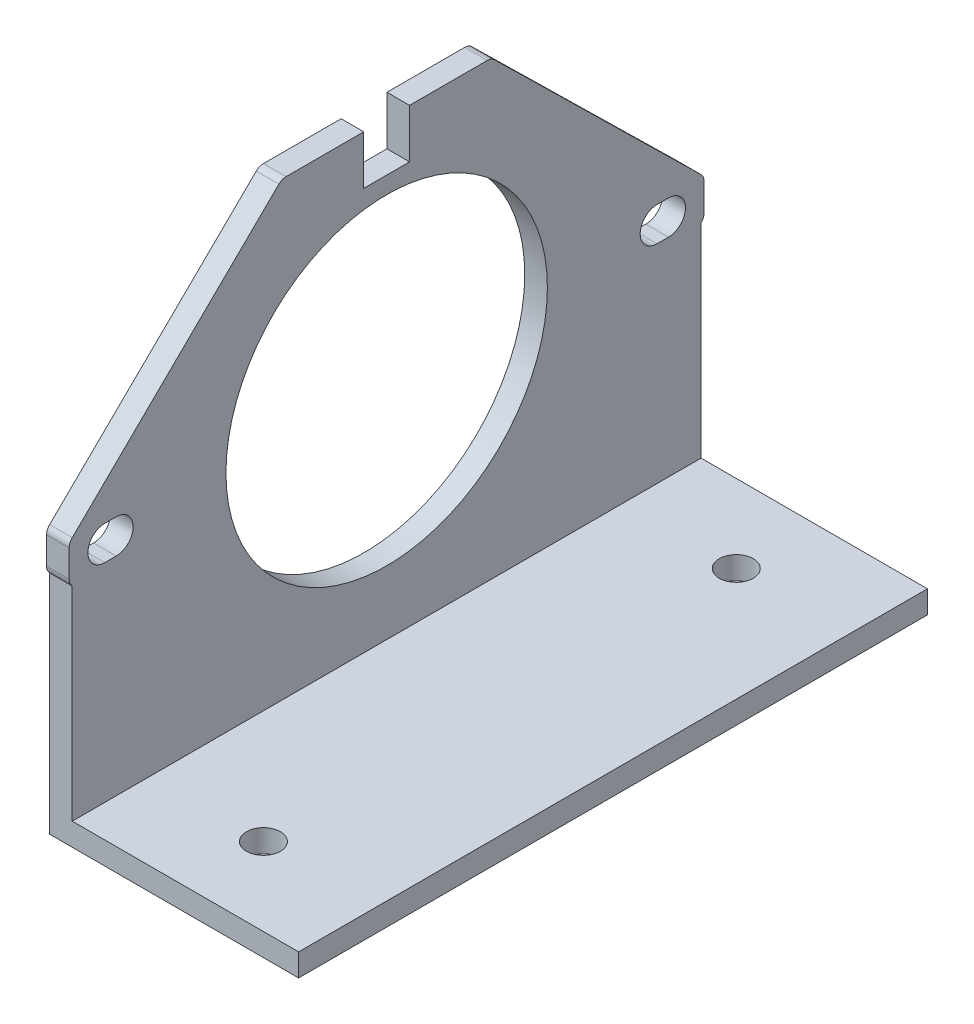
ISO-10303-21;
HEADER;
FILE_DESCRIPTION(('STEP AP214'),'2;1');
FILE_NAME('part.step','',(''),(''),'','','');
FILE_SCHEMA(('AUTOMOTIVE_DESIGN { 1 0 10303 214 1 1 1 1 }'));
ENDSEC;
DATA;
#1=APPLICATION_CONTEXT('core data for automotive mechanical design processes');
#2=APPLICATION_PROTOCOL_DEFINITION('international standard','automotive_design',2000,#1);
#3=PRODUCT_CONTEXT('',#1,'mechanical');
#4=PRODUCT('Part','Part','',(#3));
#5=PRODUCT_RELATED_PRODUCT_CATEGORY('part','',(#4));
#6=PRODUCT_DEFINITION_FORMATION('','',#4);
#7=PRODUCT_DEFINITION_CONTEXT('part definition',#1,'design');
#8=PRODUCT_DEFINITION('design','',#6,#7);
#9=PRODUCT_DEFINITION_SHAPE('','',#8);
#10=(LENGTH_UNIT() NAMED_UNIT(*) SI_UNIT(.MILLI.,.METRE.));
#11=(NAMED_UNIT(*) PLANE_ANGLE_UNIT() SI_UNIT($,.RADIAN.));
#12=(NAMED_UNIT(*) SI_UNIT($,.STERADIAN.) SOLID_ANGLE_UNIT());
#13=UNCERTAINTY_MEASURE_WITH_UNIT(LENGTH_MEASURE(1.E-05),#10,'distance_accuracy_value','');
#14=(GEOMETRIC_REPRESENTATION_CONTEXT(3) GLOBAL_UNCERTAINTY_ASSIGNED_CONTEXT((#13)) GLOBAL_UNIT_ASSIGNED_CONTEXT((#10,
#11,#12)) REPRESENTATION_CONTEXT('',''));
#15=CARTESIAN_POINT('',(0.,0.,0.));
#16=DIRECTION('',(0.,0.,1.));
#17=DIRECTION('',(1.,0.,0.));
#18=AXIS2_PLACEMENT_3D('',#15,#16,#17);
#19=CARTESIAN_POINT('',(609.088883620938,876.694420906275,-1.75182171762627E-12));
#20=DIRECTION('',(0.,-1.,0.));
#21=DIRECTION('',(0.,0.,-1.));
#22=AXIS2_PLACEMENT_3D('',#19,#20,#21);
#23=PLANE('',#22);
#24=CARTESIAN_POINT('',(680.139739498127,876.694420906278,1325.7007075967));
#25=DIRECTION('',(0.,-1.,0.));
#26=DIRECTION('',(0.,0.,-1.));
#27=AXIS2_PLACEMENT_3D('',#24,#25,#26);
#28=CIRCLE('',#27,1.49999999999994);
#29=CARTESIAN_POINT('',(680.139739498127,876.694420906278,1324.2007075967));
#30=VERTEX_POINT('',#29);
#31=EDGE_CURVE('E687',#30,#30,#28,.T.);
#32=ORIENTED_EDGE('',*,*,#31,.F.);
#33=EDGE_LOOP('',(#32));
#34=FACE_BOUND('',#33,.T.);
#35=DIRECTION('',(0.,0.,1.));
#36=VECTOR('',#35,1.);
#37=CARTESIAN_POINT('',(668.139739498127,876.694420906275,-1.75182171762627E-12));
#38=LINE('',#37,#36);
#39=CARTESIAN_POINT('',(668.139739498127,876.694420906278,1277.03010028587));
#40=VERTEX_POINT('',#39);
#41=CARTESIAN_POINT('',(668.139739498127,876.694420906278,1332.59091003364));
#42=VERTEX_POINT('',#41);
#43=EDGE_CURVE('E429',#40,#42,#38,.T.);
#44=ORIENTED_EDGE('',*,*,#43,.F.);
#45=DIRECTION('',(1.,0.,0.));
#46=VECTOR('',#45,1.);
#47=CARTESIAN_POINT('',(609.088883620938,876.694420906278,1277.03010028587));
#48=LINE('',#47,#46);
#49=CARTESIAN_POINT('',(690.139739498127,876.694420906278,1277.03010028587));
#50=VERTEX_POINT('',#49);
#51=EDGE_CURVE('E424',#40,#50,#48,.T.);
#52=ORIENTED_EDGE('',*,*,#51,.T.);
#53=DIRECTION('',(0.,0.,-1.));
#54=VECTOR('',#53,1.);
#55=CARTESIAN_POINT('',(690.139739498127,876.694420906275,-1.75182171762627E-12));
#56=LINE('',#55,#54);
#57=CARTESIAN_POINT('',(690.139739498127,876.694420906278,1332.59091003364));
#58=VERTEX_POINT('',#57);
#59=EDGE_CURVE('E662',#58,#50,#56,.T.);
#60=ORIENTED_EDGE('',*,*,#59,.F.);
#61=DIRECTION('',(1.,0.,0.));
#62=VECTOR('',#61,1.);
#63=CARTESIAN_POINT('',(609.088883620938,876.694420906278,1332.59091003364));
#64=LINE('',#63,#62);
#65=EDGE_CURVE('E568',#42,#58,#64,.T.);
#66=ORIENTED_EDGE('',*,*,#65,.F.);
#67=EDGE_LOOP('',(#44,#52,#60,#66));
#68=FACE_BOUND('',#67,.T.);
#69=CARTESIAN_POINT('',(680.139739498127,876.694420906278,1283.92030272281));
#70=DIRECTION('',(0.,-1.,0.));
#71=DIRECTION('',(0.,0.,-1.));
#72=AXIS2_PLACEMENT_3D('',#69,#70,#71);
#73=CIRCLE('',#72,1.49999999999994);
#74=CARTESIAN_POINT('',(680.139739498127,876.694420906278,1282.42030272281));
#75=VERTEX_POINT('',#74);
#76=EDGE_CURVE('E676',#75,#75,#73,.F.);
#77=ORIENTED_EDGE('',*,*,#76,.T.);
#78=EDGE_LOOP('',(#77));
#79=FACE_BOUND('',#78,.T.);
#80=ADVANCED_FACE('F45',(#34,#68,#79),#23,.T.);
#81=CARTESIAN_POINT('',(690.139739498127,878.694420906278,0.));
#82=DIRECTION('',(0.,1.,0.));
#83=DIRECTION('',(0.,0.,1.));
#84=AXIS2_PLACEMENT_3D('',#81,#82,#83);
#85=PLANE('',#84);
#86=CARTESIAN_POINT('',(680.139739498127,878.694420906278,1325.7007075967));
#87=DIRECTION('',(0.,1.,0.));
#88=DIRECTION('',(0.,0.,1.));
#89=AXIS2_PLACEMENT_3D('',#86,#87,#88);
#90=CIRCLE('',#89,1.49999999999994);
#91=CARTESIAN_POINT('',(680.139739498127,878.694420906278,1327.2007075967));
#92=VERTEX_POINT('',#91);
#93=EDGE_CURVE('E694',#92,#92,#90,.F.);
#94=ORIENTED_EDGE('',*,*,#93,.T.);
#95=EDGE_LOOP('',(#94));
#96=FACE_BOUND('',#95,.T.);
#97=DIRECTION('',(0.,0.,-1.));
#98=VECTOR('',#97,1.);
#99=CARTESIAN_POINT('',(670.139739498127,878.694420906278,0.));
#100=LINE('',#99,#98);
#101=CARTESIAN_POINT('',(670.139739498127,878.694420906278,1332.59091003364));
#102=VERTEX_POINT('',#101);
#103=CARTESIAN_POINT('',(670.139739498127,878.694420906278,1277.03010028587));
#104=VERTEX_POINT('',#103);
#105=EDGE_CURVE('E640',#102,#104,#100,.T.);
#106=ORIENTED_EDGE('',*,*,#105,.F.);
#107=DIRECTION('',(-1.,0.,0.));
#108=VECTOR('',#107,1.);
#109=CARTESIAN_POINT('',(690.139739498127,878.694420906278,1332.59091003364));
#110=LINE('',#109,#108);
#111=CARTESIAN_POINT('',(690.139739498127,878.694420906278,1332.59091003364));
#112=VERTEX_POINT('',#111);
#113=EDGE_CURVE('E647',#112,#102,#110,.T.);
#114=ORIENTED_EDGE('',*,*,#113,.F.);
#115=DIRECTION('',(0.,0.,-1.));
#116=VECTOR('',#115,1.);
#117=CARTESIAN_POINT('',(690.139739498127,878.694420906278,0.));
#118=LINE('',#117,#116);
#119=CARTESIAN_POINT('',(690.139739498127,878.694420906278,1277.03010028587));
#120=VERTEX_POINT('',#119);
#121=EDGE_CURVE('E663',#112,#120,#118,.T.);
#122=ORIENTED_EDGE('',*,*,#121,.T.);
#123=DIRECTION('',(-1.,0.,0.));
#124=VECTOR('',#123,1.);
#125=CARTESIAN_POINT('',(690.139739498127,878.694420906278,1277.03010028587));
#126=LINE('',#125,#124);
#127=EDGE_CURVE('E63',#120,#104,#126,.T.);
#128=ORIENTED_EDGE('',*,*,#127,.T.);
#129=EDGE_LOOP('',(#106,#114,#122,#128));
#130=FACE_BOUND('',#129,.T.);
#131=CARTESIAN_POINT('',(680.139739498127,878.694420906278,1283.92030272281));
#132=DIRECTION('',(0.,1.,0.));
#133=DIRECTION('',(0.,0.,1.));
#134=AXIS2_PLACEMENT_3D('',#131,#132,#133);
#135=CIRCLE('',#134,1.49999999999994);
#136=CARTESIAN_POINT('',(680.139739498127,878.694420906278,1285.42030272281));
#137=VERTEX_POINT('',#136);
#138=EDGE_CURVE('E684',#137,#137,#135,.T.);
#139=ORIENTED_EDGE('',*,*,#138,.F.);
#140=EDGE_LOOP('',(#139));
#141=FACE_BOUND('',#140,.T.);
#142=ADVANCED_FACE('F536',(#96,#130,#141),#85,.T.);
#143=CARTESIAN_POINT('',(670.139739498127,0.,0.));
#144=DIRECTION('',(1.,0.,0.));
#145=DIRECTION('',(0.,0.,-1.));
#146=AXIS2_PLACEMENT_3D('',#143,#144,#145);
#147=PLANE('',#146);
#148=CARTESIAN_POINT('',(670.139739498127,898.542038946062,1304.81050515975));
#149=DIRECTION('',(1.,0.,0.));
#150=DIRECTION('',(0.,0.,-1.));
#151=AXIS2_PLACEMENT_3D('',#148,#149,#150);
#152=CIRCLE('',#151,14.2);
#153=CARTESIAN_POINT('',(670.139739498127,898.542038946062,1290.61050515975));
#154=VERTEX_POINT('',#153);
#155=EDGE_CURVE('E323',#154,#154,#152,.T.);
#156=ORIENTED_EDGE('',*,*,#155,.F.);
#157=EDGE_LOOP('',(#156));
#158=FACE_BOUND('',#157,.T.);
#159=DIRECTION('',(0.,0.,-1.));
#160=VECTOR('',#159,1.);
#161=CARTESIAN_POINT('',(670.139739498127,900.042038946062,-1.95165506790717E-13));
#162=LINE('',#161,#160);
#163=CARTESIAN_POINT('',(670.139739498127,900.042038946062,1329.71050515975));
#164=VERTEX_POINT('',#163);
#165=CARTESIAN_POINT('',(670.139739498127,900.042038946062,1328.71050515975));
#166=VERTEX_POINT('',#165);
#167=EDGE_CURVE('E484',#164,#166,#162,.T.);
#168=ORIENTED_EDGE('',*,*,#167,.T.);
#169=CARTESIAN_POINT('',(670.139739498127,898.542038946062,1328.71050515975));
#170=DIRECTION('',(1.,0.,0.));
#171=DIRECTION('',(0.,0.,-1.));
#172=AXIS2_PLACEMENT_3D('',#169,#170,#171);
#173=CIRCLE('',#172,1.5);
#174=CARTESIAN_POINT('',(670.139739498127,897.042038946062,1328.71050515975));
#175=VERTEX_POINT('',#174);
#176=EDGE_CURVE('E488',#166,#175,#173,.F.);
#177=ORIENTED_EDGE('',*,*,#176,.T.);
#178=DIRECTION('',(0.,0.,1.));
#179=VECTOR('',#178,1.);
#180=CARTESIAN_POINT('',(670.139739498127,897.042038946063,1.94514985487226E-13));
#181=LINE('',#180,#179);
#182=CARTESIAN_POINT('',(670.139739498127,897.042038946062,1329.71050515975));
#183=VERTEX_POINT('',#182);
#184=EDGE_CURVE('E491',#175,#183,#181,.T.);
#185=ORIENTED_EDGE('',*,*,#184,.T.);
#186=CARTESIAN_POINT('',(670.139739498127,898.542038946062,1329.71050515975));
#187=DIRECTION('',(1.,0.,0.));
#188=DIRECTION('',(0.,0.,-1.));
#189=AXIS2_PLACEMENT_3D('',#186,#187,#188);
#190=CIRCLE('',#189,1.5);
#191=EDGE_CURVE('E494',#183,#164,#190,.F.);
#192=ORIENTED_EDGE('',*,*,#191,.T.);
#193=EDGE_LOOP('',(#168,#177,#185,#192));
#194=FACE_BOUND('',#193,.T.);
#195=CARTESIAN_POINT('',(670.139739498127,898.542038946062,1279.91050515975));
#196=DIRECTION('',(1.,0.,0.));
#197=DIRECTION('',(0.,0.,-1.));
#198=AXIS2_PLACEMENT_3D('',#195,#196,#197);
#199=CIRCLE('',#198,1.5);
#200=CARTESIAN_POINT('',(670.139739498127,900.042038946062,1279.91050515975));
#201=VERTEX_POINT('',#200);
#202=CARTESIAN_POINT('',(670.139739498127,897.042038946062,1279.91050515975));
#203=VERTEX_POINT('',#202);
#204=EDGE_CURVE('E228',#201,#203,#199,.F.);
#205=ORIENTED_EDGE('',*,*,#204,.T.);
#206=DIRECTION('',(0.,0.,1.));
#207=VECTOR('',#206,1.);
#208=CARTESIAN_POINT('',(670.139739498127,897.042038946062,-1.94514985487226E-13));
#209=LINE('',#208,#207);
#210=CARTESIAN_POINT('',(670.139739498127,897.042038946062,1280.91050515975));
#211=VERTEX_POINT('',#210);
#212=EDGE_CURVE('E221',#203,#211,#209,.T.);
#213=ORIENTED_EDGE('',*,*,#212,.T.);
#214=CARTESIAN_POINT('',(670.139739498127,898.542038946062,1280.91050515975));
#215=DIRECTION('',(1.,0.,0.));
#216=DIRECTION('',(0.,0.,-1.));
#217=AXIS2_PLACEMENT_3D('',#214,#215,#216);
#218=CIRCLE('',#217,1.5);
#219=CARTESIAN_POINT('',(670.139739498127,900.042038946062,1280.91050515975));
#220=VERTEX_POINT('',#219);
#221=EDGE_CURVE('E225',#211,#220,#218,.F.);
#222=ORIENTED_EDGE('',*,*,#221,.T.);
#223=DIRECTION('',(0.,0.,-1.));
#224=VECTOR('',#223,1.);
#225=CARTESIAN_POINT('',(670.139739498127,900.042038946063,1.95165506790717E-13));
#226=LINE('',#225,#224);
#227=EDGE_CURVE('E72',#220,#201,#226,.T.);
#228=ORIENTED_EDGE('',*,*,#227,.T.);
#229=EDGE_LOOP('',(#205,#213,#222,#228));
#230=FACE_BOUND('',#229,.T.);
#231=DIRECTION('',(0.,-1.,0.));
#232=VECTOR('',#231,1.);
#233=CARTESIAN_POINT('',(670.139739498127,0.,1332.59091003364));
#234=LINE('',#233,#232);
#235=CARTESIAN_POINT('',(670.139739498127,896.694420906278,1332.59091003364));
#236=VERTEX_POINT('',#235);
#237=EDGE_CURVE('E574',#236,#102,#234,.T.);
#238=ORIENTED_EDGE('',*,*,#237,.T.);
#239=ORIENTED_EDGE('',*,*,#105,.T.);
#240=DIRECTION('',(0.,1.,0.));
#241=VECTOR('',#240,1.);
#242=CARTESIAN_POINT('',(670.139739498127,0.,1277.03010028587));
#243=LINE('',#242,#241);
#244=CARTESIAN_POINT('',(670.139739498127,896.694420906278,1277.03010028587));
#245=VERTEX_POINT('',#244);
#246=EDGE_CURVE('E158',#104,#245,#243,.T.);
#247=ORIENTED_EDGE('',*,*,#246,.T.);
#248=CARTESIAN_POINT('',(670.139739498127,897.336752358861,1277.66050515975));
#249=DIRECTION('',(1.,0.,0.));
#250=DIRECTION('',(0.,0.,-1.));
#251=AXIS2_PLACEMENT_3D('',#248,#249,#250);
#252=CIRCLE('',#251,0.9);
#253=CARTESIAN_POINT('',(670.139739498127,897.336752358861,1276.76050515975));
#254=VERTEX_POINT('',#253);
#255=EDGE_CURVE('E414',#245,#254,#252,.T.);
#256=ORIENTED_EDGE('',*,*,#255,.T.);
#257=DIRECTION('',(0.,1.,0.));
#258=VECTOR('',#257,1.);
#259=CARTESIAN_POINT('',(670.139739498127,0.,1276.76050515975));
#260=LINE('',#259,#258);
#261=CARTESIAN_POINT('',(670.139739498127,899.747325533264,1276.76050515975));
#262=VERTEX_POINT('',#261);
#263=EDGE_CURVE('E442',#254,#262,#260,.T.);
#264=ORIENTED_EDGE('',*,*,#263,.T.);
#265=CARTESIAN_POINT('',(670.139739498127,899.747325533264,1277.66050515975));
#266=DIRECTION('',(1.,0.,0.));
#267=DIRECTION('',(0.,0.,-1.));
#268=AXIS2_PLACEMENT_3D('',#265,#266,#267);
#269=CIRCLE('',#268,0.9);
#270=CARTESIAN_POINT('',(670.139739498127,900.389656985847,1277.03010028587));
#271=VERTEX_POINT('',#270);
#272=EDGE_CURVE('E445',#262,#271,#269,.T.);
#273=ORIENTED_EDGE('',*,*,#272,.T.);
#274=DIRECTION('',(0.,0.700449859875832,0.713701613981591));
#275=VECTOR('',#274,1.);
#276=CARTESIAN_POINT('',(670.139739498127,-179.77144716547,176.433515785739));
#277=LINE('',#276,#275);
#278=CARTESIAN_POINT('',(670.139739498127,918.309370398646,1295.28883530377));
#279=VERTEX_POINT('',#278);
#280=EDGE_CURVE('E448',#271,#279,#277,.T.);
#281=ORIENTED_EDGE('',*,*,#280,.T.);
#282=CARTESIAN_POINT('',(670.139739498127,917.667038946062,1295.91924017766));
#283=DIRECTION('',(1.,0.,0.));
#284=DIRECTION('',(0.,0.,-1.));
#285=AXIS2_PLACEMENT_3D('',#282,#283,#284);
#286=CIRCLE('',#285,0.9);
#287=CARTESIAN_POINT('',(670.139739498127,918.567038946062,1295.91924017766));
#288=VERTEX_POINT('',#287);
#289=EDGE_CURVE('E451',#279,#288,#286,.T.);
#290=ORIENTED_EDGE('',*,*,#289,.T.);
#291=DIRECTION('',(0.,0.,1.));
#292=VECTOR('',#291,1.);
#293=CARTESIAN_POINT('',(670.139739498127,918.567038946062,0.));
#294=LINE('',#293,#292);
#295=CARTESIAN_POINT('',(670.139739498127,918.567038946062,1302.78550515975));
#296=VERTEX_POINT('',#295);
#297=EDGE_CURVE('E454',#288,#296,#294,.T.);
#298=ORIENTED_EDGE('',*,*,#297,.T.);
#299=DIRECTION('',(0.,-1.,0.));
#300=VECTOR('',#299,1.);
#301=CARTESIAN_POINT('',(670.139739498127,0.,1302.78550515975));
#302=LINE('',#301,#300);
#303=CARTESIAN_POINT('',(670.139739498127,914.242038946062,1302.78550515975));
#304=VERTEX_POINT('',#303);
#305=EDGE_CURVE('E457',#296,#304,#302,.T.);
#306=ORIENTED_EDGE('',*,*,#305,.T.);
#307=DIRECTION('',(0.,0.,1.));
#308=VECTOR('',#307,1.);
#309=CARTESIAN_POINT('',(670.139739498127,914.242038946062,0.));
#310=LINE('',#309,#308);
#311=CARTESIAN_POINT('',(670.139739498127,914.242038946062,1306.83550515975));
#312=VERTEX_POINT('',#311);
#313=EDGE_CURVE('E460',#304,#312,#310,.T.);
#314=ORIENTED_EDGE('',*,*,#313,.T.);
#315=DIRECTION('',(0.,1.,0.));
#316=VECTOR('',#315,1.);
#317=CARTESIAN_POINT('',(670.139739498127,0.,1306.83550515975));
#318=LINE('',#317,#316);
#319=CARTESIAN_POINT('',(670.139739498127,918.567038946062,1306.83550515975));
#320=VERTEX_POINT('',#319);
#321=EDGE_CURVE('E463',#312,#320,#318,.T.);
#322=ORIENTED_EDGE('',*,*,#321,.T.);
#323=DIRECTION('',(0.,0.,1.));
#324=VECTOR('',#323,1.);
#325=CARTESIAN_POINT('',(670.139739498127,918.567038946062,0.));
#326=LINE('',#325,#324);
#327=CARTESIAN_POINT('',(670.139739498127,918.567038946062,1313.70177014185));
#328=VERTEX_POINT('',#327);
#329=EDGE_CURVE('E466',#320,#328,#326,.T.);
#330=ORIENTED_EDGE('',*,*,#329,.T.);
#331=CARTESIAN_POINT('',(670.139739498127,917.667038946062,1313.70177014185));
#332=DIRECTION('',(1.,0.,0.));
#333=DIRECTION('',(0.,0.,-1.));
#334=AXIS2_PLACEMENT_3D('',#331,#332,#333);
#335=CIRCLE('',#334,0.9);
#336=CARTESIAN_POINT('',(670.139739498127,918.309370398646,1314.33217501574));
#337=VERTEX_POINT('',#336);
#338=EDGE_CURVE('E469',#328,#337,#335,.T.);
#339=ORIENTED_EDGE('',*,*,#338,.T.);
#340=DIRECTION('',(0.,-0.700449859875832,0.713701613981591));
#341=VECTOR('',#340,1.);
#342=CARTESIAN_POINT('',(670.139739498127,1124.8099215434,1103.92485668716));
#343=LINE('',#342,#341);
#344=CARTESIAN_POINT('',(670.139739498127,900.389656985847,1332.59091003364));
#345=VERTEX_POINT('',#344);
#346=EDGE_CURVE('E472',#337,#345,#343,.T.);
#347=ORIENTED_EDGE('',*,*,#346,.T.);
#348=CARTESIAN_POINT('',(670.139739498127,899.747325533264,1331.96050515975));
#349=DIRECTION('',(1.,0.,0.));
#350=DIRECTION('',(0.,0.,-1.));
#351=AXIS2_PLACEMENT_3D('',#348,#349,#350);
#352=CIRCLE('',#351,0.9);
#353=CARTESIAN_POINT('',(670.139739498127,899.747325533264,1332.86050515975));
#354=VERTEX_POINT('',#353);
#355=EDGE_CURVE('E475',#345,#354,#352,.T.);
#356=ORIENTED_EDGE('',*,*,#355,.T.);
#357=DIRECTION('',(0.,-1.,0.));
#358=VECTOR('',#357,1.);
#359=CARTESIAN_POINT('',(670.139739498127,-1.42285809754026E-12,1332.86050515975));
#360=LINE('',#359,#358);
#361=CARTESIAN_POINT('',(670.139739498127,897.336752358861,1332.86050515975));
#362=VERTEX_POINT('',#361);
#363=EDGE_CURVE('E478',#354,#362,#360,.T.);
#364=ORIENTED_EDGE('',*,*,#363,.T.);
#365=CARTESIAN_POINT('',(670.139739498127,897.336752358861,1331.96050515975));
#366=DIRECTION('',(1.,0.,0.));
#367=DIRECTION('',(0.,0.,-1.));
#368=AXIS2_PLACEMENT_3D('',#365,#366,#367);
#369=CIRCLE('',#368,0.9);
#370=EDGE_CURVE('E481',#362,#236,#369,.T.);
#371=ORIENTED_EDGE('',*,*,#370,.T.);
#372=EDGE_LOOP('',(#238,#239,#247,#256,#264,#273,#281,#290,#298,#306,#314,#322,#330,#339,#347,
#356,#364,#371));
#373=FACE_BOUND('',#372,.T.);
#374=ADVANCED_FACE('F223',(#158,#194,#230,#373),#147,.T.);
#375=CARTESIAN_POINT('',(670.139739498127,898.542038946062,1279.91050515975));
#376=DIRECTION('',(-1.,0.,0.));
#377=DIRECTION('',(0.,0.,1.));
#378=AXIS2_PLACEMENT_3D('',#375,#376,#377);
#379=CYLINDRICAL_SURFACE('',#378,1.5);
#380=CARTESIAN_POINT('',(668.139739498127,898.542038946062,1279.91050515975));
#381=DIRECTION('',(1.,0.,0.));
#382=DIRECTION('',(0.,0.,-1.));
#383=AXIS2_PLACEMENT_3D('',#380,#381,#382);
#384=CIRCLE('',#383,1.5);
#385=CARTESIAN_POINT('',(668.139739498127,900.042038946062,1279.91050515975));
#386=VERTEX_POINT('',#385);
#387=CARTESIAN_POINT('',(668.139739498127,897.042038946062,1279.91050515975));
#388=VERTEX_POINT('',#387);
#389=EDGE_CURVE('E312',#386,#388,#384,.F.);
#390=ORIENTED_EDGE('',*,*,#389,.T.);
#391=DIRECTION('',(-1.,0.,0.));
#392=VECTOR('',#391,1.);
#393=CARTESIAN_POINT('',(670.139739498127,897.042038946062,1279.91050515975));
#394=LINE('',#393,#392);
#395=EDGE_CURVE('E11',#203,#388,#394,.T.);
#396=ORIENTED_EDGE('',*,*,#395,.F.);
#397=ORIENTED_EDGE('',*,*,#204,.F.);
#398=DIRECTION('',(-1.,0.,0.));
#399=VECTOR('',#398,1.);
#400=CARTESIAN_POINT('',(670.139739498127,900.042038946062,1279.91050515975));
#401=LINE('',#400,#399);
#402=EDGE_CURVE('E324',#201,#386,#401,.T.);
#403=ORIENTED_EDGE('',*,*,#402,.T.);
#404=EDGE_LOOP('',(#390,#396,#397,#403));
#405=FACE_BOUND('',#404,.T.);
#406=ADVANCED_FACE('F526',(#405),#379,.F.);
#407=CARTESIAN_POINT('',(670.139739498127,897.042038946062,-1.94514985487226E-13));
#408=DIRECTION('',(0.,-1.,0.));
#409=DIRECTION('',(0.,0.,-1.));
#410=AXIS2_PLACEMENT_3D('',#407,#408,#409);
#411=PLANE('',#410);
#412=DIRECTION('',(0.,0.,1.));
#413=VECTOR('',#412,1.);
#414=CARTESIAN_POINT('',(668.139739498127,897.042038946062,-1.94514985487226E-13));
#415=LINE('',#414,#413);
#416=CARTESIAN_POINT('',(668.139739498127,897.042038946062,1280.91050515975));
#417=VERTEX_POINT('',#416);
#418=EDGE_CURVE('E235',#388,#417,#415,.T.);
#419=ORIENTED_EDGE('',*,*,#418,.T.);
#420=DIRECTION('',(-1.,0.,0.));
#421=VECTOR('',#420,1.);
#422=CARTESIAN_POINT('',(670.139739498127,897.042038946062,1280.91050515975));
#423=LINE('',#422,#421);
#424=EDGE_CURVE('E55',#211,#417,#423,.T.);
#425=ORIENTED_EDGE('',*,*,#424,.F.);
#426=ORIENTED_EDGE('',*,*,#212,.F.);
#427=ORIENTED_EDGE('',*,*,#395,.T.);
#428=EDGE_LOOP('',(#419,#425,#426,#427));
#429=FACE_BOUND('',#428,.T.);
#430=ADVANCED_FACE('F234',(#429),#411,.F.);
#431=CARTESIAN_POINT('',(670.139739498127,898.542038946062,1280.91050515975));
#432=DIRECTION('',(-1.,0.,0.));
#433=DIRECTION('',(0.,0.,1.));
#434=AXIS2_PLACEMENT_3D('',#431,#432,#433);
#435=CYLINDRICAL_SURFACE('',#434,1.5);
#436=CARTESIAN_POINT('',(668.139739498127,898.542038946062,1280.91050515975));
#437=DIRECTION('',(1.,0.,0.));
#438=DIRECTION('',(0.,0.,-1.));
#439=AXIS2_PLACEMENT_3D('',#436,#437,#438);
#440=CIRCLE('',#439,1.5);
#441=CARTESIAN_POINT('',(668.139739498127,900.042038946062,1280.91050515975));
#442=VERTEX_POINT('',#441);
#443=EDGE_CURVE('E318',#417,#442,#440,.F.);
#444=ORIENTED_EDGE('',*,*,#443,.T.);
#445=DIRECTION('',(-1.,0.,0.));
#446=VECTOR('',#445,1.);
#447=CARTESIAN_POINT('',(670.139739498127,900.042038946062,1280.91050515975));
#448=LINE('',#447,#446);
#449=EDGE_CURVE('E239',#220,#442,#448,.T.);
#450=ORIENTED_EDGE('',*,*,#449,.F.);
#451=ORIENTED_EDGE('',*,*,#221,.F.);
#452=ORIENTED_EDGE('',*,*,#424,.T.);
#453=EDGE_LOOP('',(#444,#450,#451,#452));
#454=FACE_BOUND('',#453,.T.);
#455=ADVANCED_FACE('F241',(#454),#435,.F.);
#456=CARTESIAN_POINT('',(670.139739498127,900.042038946062,-1.95165506790717E-13));
#457=DIRECTION('',(0.,1.,0.));
#458=DIRECTION('',(0.,0.,1.));
#459=AXIS2_PLACEMENT_3D('',#456,#457,#458);
#460=PLANE('',#459);
#461=DIRECTION('',(0.,0.,-1.));
#462=VECTOR('',#461,1.);
#463=CARTESIAN_POINT('',(668.139739498127,900.042038946062,-1.95165506790717E-13));
#464=LINE('',#463,#462);
#465=CARTESIAN_POINT('',(668.139739498127,900.042038946062,1329.71050515975));
#466=VERTEX_POINT('',#465);
#467=CARTESIAN_POINT('',(668.139739498127,900.042038946062,1328.71050515975));
#468=VERTEX_POINT('',#467);
#469=EDGE_CURVE('E299',#466,#468,#464,.T.);
#470=ORIENTED_EDGE('',*,*,#469,.T.);
#471=DIRECTION('',(-1.,0.,0.));
#472=VECTOR('',#471,1.);
#473=CARTESIAN_POINT('',(670.139739498127,900.042038946062,1328.71050515975));
#474=LINE('',#473,#472);
#475=EDGE_CURVE('E327',#166,#468,#474,.T.);
#476=ORIENTED_EDGE('',*,*,#475,.F.);
#477=ORIENTED_EDGE('',*,*,#167,.F.);
#478=DIRECTION('',(-1.,0.,0.));
#479=VECTOR('',#478,1.);
#480=CARTESIAN_POINT('',(670.139739498127,900.042038946062,1329.71050515975));
#481=LINE('',#480,#479);
#482=EDGE_CURVE('E330',#164,#466,#481,.T.);
#483=ORIENTED_EDGE('',*,*,#482,.T.);
#484=EDGE_LOOP('',(#470,#476,#477,#483));
#485=FACE_BOUND('',#484,.T.);
#486=ADVANCED_FACE('F509',(#485),#460,.F.);
#487=CARTESIAN_POINT('',(670.139739498127,898.542038946062,1328.71050515975));
#488=DIRECTION('',(-1.,0.,0.));
#489=DIRECTION('',(0.,0.,1.));
#490=AXIS2_PLACEMENT_3D('',#487,#488,#489);
#491=CYLINDRICAL_SURFACE('',#490,1.5);
#492=CARTESIAN_POINT('',(668.139739498127,898.542038946062,1328.71050515975));
#493=DIRECTION('',(1.,0.,0.));
#494=DIRECTION('',(0.,0.,-1.));
#495=AXIS2_PLACEMENT_3D('',#492,#493,#494);
#496=CIRCLE('',#495,1.5);
#497=CARTESIAN_POINT('',(668.139739498127,897.042038946062,1328.71050515975));
#498=VERTEX_POINT('',#497);
#499=EDGE_CURVE('E303',#468,#498,#496,.F.);
#500=ORIENTED_EDGE('',*,*,#499,.T.);
#501=DIRECTION('',(-1.,0.,0.));
#502=VECTOR('',#501,1.);
#503=CARTESIAN_POINT('',(670.139739498127,897.042038946062,1328.71050515975));
#504=LINE('',#503,#502);
#505=EDGE_CURVE('E338',#175,#498,#504,.T.);
#506=ORIENTED_EDGE('',*,*,#505,.F.);
#507=ORIENTED_EDGE('',*,*,#176,.F.);
#508=ORIENTED_EDGE('',*,*,#475,.T.);
#509=EDGE_LOOP('',(#500,#506,#507,#508));
#510=FACE_BOUND('',#509,.T.);
#511=ADVANCED_FACE('F511',(#510),#491,.F.);
#512=CARTESIAN_POINT('',(670.139739498127,897.042038946063,1.94514985487226E-13));
#513=DIRECTION('',(0.,-1.,0.));
#514=DIRECTION('',(0.,0.,-1.));
#515=AXIS2_PLACEMENT_3D('',#512,#513,#514);
#516=PLANE('',#515);
#517=DIRECTION('',(0.,0.,1.));
#518=VECTOR('',#517,1.);
#519=CARTESIAN_POINT('',(668.139739498127,897.042038946063,1.94514985487226E-13));
#520=LINE('',#519,#518);
#521=CARTESIAN_POINT('',(668.139739498127,897.042038946062,1329.71050515975));
#522=VERTEX_POINT('',#521);
#523=EDGE_CURVE('E306',#498,#522,#520,.T.);
#524=ORIENTED_EDGE('',*,*,#523,.T.);
#525=DIRECTION('',(-1.,0.,0.));
#526=VECTOR('',#525,1.);
#527=CARTESIAN_POINT('',(670.139739498127,897.042038946062,1329.71050515975));
#528=LINE('',#527,#526);
#529=EDGE_CURVE('E334',#183,#522,#528,.T.);
#530=ORIENTED_EDGE('',*,*,#529,.F.);
#531=ORIENTED_EDGE('',*,*,#184,.F.);
#532=ORIENTED_EDGE('',*,*,#505,.T.);
#533=EDGE_LOOP('',(#524,#530,#531,#532));
#534=FACE_BOUND('',#533,.T.);
#535=ADVANCED_FACE('F515',(#534),#516,.F.);
#536=CARTESIAN_POINT('',(670.139739498127,897.336752358861,1277.66050515975));
#537=DIRECTION('',(-1.,0.,0.));
#538=DIRECTION('',(0.,0.,1.));
#539=AXIS2_PLACEMENT_3D('',#536,#537,#538);
#540=CYLINDRICAL_SURFACE('',#539,0.9);
#541=CARTESIAN_POINT('',(668.139739498127,897.336752358861,1277.66050515975));
#542=DIRECTION('',(1.,0.,0.));
#543=DIRECTION('',(0.,0.,-1.));
#544=AXIS2_PLACEMENT_3D('',#541,#542,#543);
#545=CIRCLE('',#544,0.9);
#546=CARTESIAN_POINT('',(668.139739498127,896.694420906278,1277.03010028587));
#547=VERTEX_POINT('',#546);
#548=CARTESIAN_POINT('',(668.139739498127,897.336752358861,1276.76050515975));
#549=VERTEX_POINT('',#548);
#550=EDGE_CURVE('E253',#547,#549,#545,.T.);
#551=ORIENTED_EDGE('',*,*,#550,.T.);
#552=DIRECTION('',(-1.,0.,0.));
#553=VECTOR('',#552,1.);
#554=CARTESIAN_POINT('',(670.139739498127,897.336752358861,1276.76050515975));
#555=LINE('',#554,#553);
#556=EDGE_CURVE('E399',#254,#549,#555,.T.);
#557=ORIENTED_EDGE('',*,*,#556,.F.);
#558=ORIENTED_EDGE('',*,*,#255,.F.);
#559=DIRECTION('',(-1.,0.,0.));
#560=VECTOR('',#559,1.);
#561=CARTESIAN_POINT('',(670.139739498127,896.694420906278,1277.03010028587));
#562=LINE('',#561,#560);
#563=EDGE_CURVE('E49',#245,#547,#562,.T.);
#564=ORIENTED_EDGE('',*,*,#563,.T.);
#565=EDGE_LOOP('',(#551,#557,#558,#564));
#566=FACE_BOUND('',#565,.T.);
#567=ADVANCED_FACE('F412',(#566),#540,.T.);
#568=CARTESIAN_POINT('',(670.139739498127,0.,1276.76050515975));
#569=DIRECTION('',(0.,0.,1.));
#570=DIRECTION('',(1.,0.,0.));
#571=AXIS2_PLACEMENT_3D('',#568,#569,#570);
#572=PLANE('',#571);
#573=DIRECTION('',(0.,1.,0.));
#574=VECTOR('',#573,1.);
#575=CARTESIAN_POINT('',(668.139739498127,0.,1276.76050515975));
#576=LINE('',#575,#574);
#577=CARTESIAN_POINT('',(668.139739498127,899.747325533264,1276.76050515975));
#578=VERTEX_POINT('',#577);
#579=EDGE_CURVE('E257',#549,#578,#576,.T.);
#580=ORIENTED_EDGE('',*,*,#579,.T.);
#581=DIRECTION('',(-1.,0.,0.));
#582=VECTOR('',#581,1.);
#583=CARTESIAN_POINT('',(670.139739498127,899.747325533264,1276.76050515975));
#584=LINE('',#583,#582);
#585=EDGE_CURVE('E396',#262,#578,#584,.T.);
#586=ORIENTED_EDGE('',*,*,#585,.F.);
#587=ORIENTED_EDGE('',*,*,#263,.F.);
#588=ORIENTED_EDGE('',*,*,#556,.T.);
#589=EDGE_LOOP('',(#580,#586,#587,#588));
#590=FACE_BOUND('',#589,.T.);
#591=ADVANCED_FACE('F638',(#590),#572,.F.);
#592=CARTESIAN_POINT('',(670.139739498127,899.747325533264,1277.66050515975));
#593=DIRECTION('',(-1.,0.,0.));
#594=DIRECTION('',(0.,0.,1.));
#595=AXIS2_PLACEMENT_3D('',#592,#593,#594);
#596=CYLINDRICAL_SURFACE('',#595,0.9);
#597=CARTESIAN_POINT('',(668.139739498127,899.747325533264,1277.66050515975));
#598=DIRECTION('',(1.,0.,0.));
#599=DIRECTION('',(0.,0.,-1.));
#600=AXIS2_PLACEMENT_3D('',#597,#598,#599);
#601=CIRCLE('',#600,0.9);
#602=CARTESIAN_POINT('',(668.139739498127,900.389656985847,1277.03010028587));
#603=VERTEX_POINT('',#602);
#604=EDGE_CURVE('E260',#578,#603,#601,.T.);
#605=ORIENTED_EDGE('',*,*,#604,.T.);
#606=DIRECTION('',(-1.,0.,0.));
#607=VECTOR('',#606,1.);
#608=CARTESIAN_POINT('',(670.139739498127,900.389656985847,1277.03010028587));
#609=LINE('',#608,#607);
#610=EDGE_CURVE('E392',#271,#603,#609,.T.);
#611=ORIENTED_EDGE('',*,*,#610,.F.);
#612=ORIENTED_EDGE('',*,*,#272,.F.);
#613=ORIENTED_EDGE('',*,*,#585,.T.);
#614=EDGE_LOOP('',(#605,#611,#612,#613));
#615=FACE_BOUND('',#614,.T.);
#616=ADVANCED_FACE('F636',(#615),#596,.T.);
#617=CARTESIAN_POINT('',(670.139739498127,-179.77144716547,176.433515785739));
#618=DIRECTION('',(0.,-0.713701613981591,0.700449859875832));
#619=DIRECTION('',(0.,-0.700449859875832,-0.713701613981591));
#620=AXIS2_PLACEMENT_3D('',#617,#618,#619);
#621=PLANE('',#620);
#622=DIRECTION('',(0.,0.700449859875832,0.713701613981591));
#623=VECTOR('',#622,1.);
#624=CARTESIAN_POINT('',(668.139739498127,-179.77144716547,176.433515785739));
#625=LINE('',#624,#623);
#626=CARTESIAN_POINT('',(668.139739498127,918.309370398646,1295.28883530377));
#627=VERTEX_POINT('',#626);
#628=EDGE_CURVE('E263',#603,#627,#625,.T.);
#629=ORIENTED_EDGE('',*,*,#628,.T.);
#630=DIRECTION('',(-1.,0.,0.));
#631=VECTOR('',#630,1.);
#632=CARTESIAN_POINT('',(670.139739498127,918.309370398646,1295.28883530377));
#633=LINE('',#632,#631);
#634=EDGE_CURVE('E388',#279,#627,#633,.T.);
#635=ORIENTED_EDGE('',*,*,#634,.F.);
#636=ORIENTED_EDGE('',*,*,#280,.F.);
#637=ORIENTED_EDGE('',*,*,#610,.T.);
#638=EDGE_LOOP('',(#629,#635,#636,#637));
#639=FACE_BOUND('',#638,.T.);
#640=ADVANCED_FACE('F631',(#639),#621,.F.);
#641=CARTESIAN_POINT('',(670.139739498127,917.667038946062,1295.91924017766));
#642=DIRECTION('',(-1.,0.,0.));
#643=DIRECTION('',(0.,0.,1.));
#644=AXIS2_PLACEMENT_3D('',#641,#642,#643);
#645=CYLINDRICAL_SURFACE('',#644,0.9);
#646=CARTESIAN_POINT('',(668.139739498127,917.667038946062,1295.91924017766));
#647=DIRECTION('',(1.,0.,0.));
#648=DIRECTION('',(0.,0.,-1.));
#649=AXIS2_PLACEMENT_3D('',#646,#647,#648);
#650=CIRCLE('',#649,0.9);
#651=CARTESIAN_POINT('',(668.139739498127,918.567038946062,1295.91924017766));
#652=VERTEX_POINT('',#651);
#653=EDGE_CURVE('E266',#627,#652,#650,.T.);
#654=ORIENTED_EDGE('',*,*,#653,.T.);
#655=DIRECTION('',(-1.,0.,0.));
#656=VECTOR('',#655,1.);
#657=CARTESIAN_POINT('',(670.139739498127,918.567038946062,1295.91924017766));
#658=LINE('',#657,#656);
#659=EDGE_CURVE('E384',#288,#652,#658,.T.);
#660=ORIENTED_EDGE('',*,*,#659,.F.);
#661=ORIENTED_EDGE('',*,*,#289,.F.);
#662=ORIENTED_EDGE('',*,*,#634,.T.);
#663=EDGE_LOOP('',(#654,#660,#661,#662));
#664=FACE_BOUND('',#663,.T.);
#665=ADVANCED_FACE('F626',(#664),#645,.T.);
#666=CARTESIAN_POINT('',(670.139739498127,918.567038946062,0.));
#667=DIRECTION('',(0.,-1.,0.));
#668=DIRECTION('',(0.,0.,-1.));
#669=AXIS2_PLACEMENT_3D('',#666,#667,#668);
#670=PLANE('',#669);
#671=DIRECTION('',(0.,0.,1.));
#672=VECTOR('',#671,1.);
#673=CARTESIAN_POINT('',(668.139739498127,918.567038946062,0.));
#674=LINE('',#673,#672);
#675=CARTESIAN_POINT('',(668.139739498127,918.567038946062,1302.78550515975));
#676=VERTEX_POINT('',#675);
#677=EDGE_CURVE('E269',#652,#676,#674,.T.);
#678=ORIENTED_EDGE('',*,*,#677,.T.);
#679=DIRECTION('',(-1.,0.,0.));
#680=VECTOR('',#679,1.);
#681=CARTESIAN_POINT('',(670.139739498127,918.567038946062,1302.78550515975));
#682=LINE('',#681,#680);
#683=EDGE_CURVE('E380',#296,#676,#682,.T.);
#684=ORIENTED_EDGE('',*,*,#683,.F.);
#685=ORIENTED_EDGE('',*,*,#297,.F.);
#686=ORIENTED_EDGE('',*,*,#659,.T.);
#687=EDGE_LOOP('',(#678,#684,#685,#686));
#688=FACE_BOUND('',#687,.T.);
#689=ADVANCED_FACE('F622',(#688),#670,.F.);
#690=CARTESIAN_POINT('',(670.139739498127,0.,1302.78550515975));
#691=DIRECTION('',(0.,0.,-1.));
#692=DIRECTION('',(-1.,0.,0.));
#693=AXIS2_PLACEMENT_3D('',#690,#691,#692);
#694=PLANE('',#693);
#695=DIRECTION('',(0.,-1.,0.));
#696=VECTOR('',#695,1.);
#697=CARTESIAN_POINT('',(668.139739498127,0.,1302.78550515975));
#698=LINE('',#697,#696);
#699=CARTESIAN_POINT('',(668.139739498127,914.242038946062,1302.78550515975));
#700=VERTEX_POINT('',#699);
#701=EDGE_CURVE('E272',#676,#700,#698,.T.);
#702=ORIENTED_EDGE('',*,*,#701,.T.);
#703=DIRECTION('',(-1.,0.,0.));
#704=VECTOR('',#703,1.);
#705=CARTESIAN_POINT('',(670.139739498127,914.242038946062,1302.78550515975));
#706=LINE('',#705,#704);
#707=EDGE_CURVE('E376',#304,#700,#706,.T.);
#708=ORIENTED_EDGE('',*,*,#707,.F.);
#709=ORIENTED_EDGE('',*,*,#305,.F.);
#710=ORIENTED_EDGE('',*,*,#683,.T.);
#711=EDGE_LOOP('',(#702,#708,#709,#710));
#712=FACE_BOUND('',#711,.T.);
#713=ADVANCED_FACE('F617',(#712),#694,.F.);
#714=CARTESIAN_POINT('',(670.139739498127,914.242038946062,0.));
#715=DIRECTION('',(0.,-1.,0.));
#716=DIRECTION('',(0.,0.,-1.));
#717=AXIS2_PLACEMENT_3D('',#714,#715,#716);
#718=PLANE('',#717);
#719=DIRECTION('',(0.,0.,1.));
#720=VECTOR('',#719,1.);
#721=CARTESIAN_POINT('',(668.139739498127,914.242038946062,0.));
#722=LINE('',#721,#720);
#723=CARTESIAN_POINT('',(668.139739498127,914.242038946062,1306.83550515975));
#724=VERTEX_POINT('',#723);
#725=EDGE_CURVE('E275',#700,#724,#722,.T.);
#726=ORIENTED_EDGE('',*,*,#725,.T.);
#727=DIRECTION('',(-1.,0.,0.));
#728=VECTOR('',#727,1.);
#729=CARTESIAN_POINT('',(670.139739498127,914.242038946062,1306.83550515975));
#730=LINE('',#729,#728);
#731=EDGE_CURVE('E372',#312,#724,#730,.T.);
#732=ORIENTED_EDGE('',*,*,#731,.F.);
#733=ORIENTED_EDGE('',*,*,#313,.F.);
#734=ORIENTED_EDGE('',*,*,#707,.T.);
#735=EDGE_LOOP('',(#726,#732,#733,#734));
#736=FACE_BOUND('',#735,.T.);
#737=ADVANCED_FACE('F611',(#736),#718,.F.);
#738=CARTESIAN_POINT('',(670.139739498127,0.,1306.83550515975));
#739=DIRECTION('',(0.,0.,1.));
#740=DIRECTION('',(1.,0.,0.));
#741=AXIS2_PLACEMENT_3D('',#738,#739,#740);
#742=PLANE('',#741);
#743=DIRECTION('',(0.,1.,0.));
#744=VECTOR('',#743,1.);
#745=CARTESIAN_POINT('',(668.139739498127,0.,1306.83550515975));
#746=LINE('',#745,#744);
#747=CARTESIAN_POINT('',(668.139739498127,918.567038946062,1306.83550515975));
#748=VERTEX_POINT('',#747);
#749=EDGE_CURVE('E278',#724,#748,#746,.T.);
#750=ORIENTED_EDGE('',*,*,#749,.T.);
#751=DIRECTION('',(-1.,0.,0.));
#752=VECTOR('',#751,1.);
#753=CARTESIAN_POINT('',(670.139739498127,918.567038946062,1306.83550515975));
#754=LINE('',#753,#752);
#755=EDGE_CURVE('E368',#320,#748,#754,.T.);
#756=ORIENTED_EDGE('',*,*,#755,.F.);
#757=ORIENTED_EDGE('',*,*,#321,.F.);
#758=ORIENTED_EDGE('',*,*,#731,.T.);
#759=EDGE_LOOP('',(#750,#756,#757,#758));
#760=FACE_BOUND('',#759,.T.);
#761=ADVANCED_FACE('F607',(#760),#742,.F.);
#762=CARTESIAN_POINT('',(670.139739498127,918.567038946062,0.));
#763=DIRECTION('',(0.,-1.,0.));
#764=DIRECTION('',(0.,0.,-1.));
#765=AXIS2_PLACEMENT_3D('',#762,#763,#764);
#766=PLANE('',#765);
#767=DIRECTION('',(0.,0.,1.));
#768=VECTOR('',#767,1.);
#769=CARTESIAN_POINT('',(668.139739498127,918.567038946062,0.));
#770=LINE('',#769,#768);
#771=CARTESIAN_POINT('',(668.139739498127,918.567038946062,1313.70177014185));
#772=VERTEX_POINT('',#771);
#773=EDGE_CURVE('E281',#748,#772,#770,.T.);
#774=ORIENTED_EDGE('',*,*,#773,.T.);
#775=DIRECTION('',(-1.,0.,0.));
#776=VECTOR('',#775,1.);
#777=CARTESIAN_POINT('',(670.139739498127,918.567038946062,1313.70177014185));
#778=LINE('',#777,#776);
#779=EDGE_CURVE('E364',#328,#772,#778,.T.);
#780=ORIENTED_EDGE('',*,*,#779,.F.);
#781=ORIENTED_EDGE('',*,*,#329,.F.);
#782=ORIENTED_EDGE('',*,*,#755,.T.);
#783=EDGE_LOOP('',(#774,#780,#781,#782));
#784=FACE_BOUND('',#783,.T.);
#785=ADVANCED_FACE('F602',(#784),#766,.F.);
#786=CARTESIAN_POINT('',(670.139739498127,917.667038946062,1313.70177014185));
#787=DIRECTION('',(-1.,0.,0.));
#788=DIRECTION('',(0.,0.,1.));
#789=AXIS2_PLACEMENT_3D('',#786,#787,#788);
#790=CYLINDRICAL_SURFACE('',#789,0.9);
#791=CARTESIAN_POINT('',(668.139739498127,917.667038946062,1313.70177014185));
#792=DIRECTION('',(1.,0.,0.));
#793=DIRECTION('',(0.,0.,-1.));
#794=AXIS2_PLACEMENT_3D('',#791,#792,#793);
#795=CIRCLE('',#794,0.9);
#796=CARTESIAN_POINT('',(668.139739498127,918.309370398646,1314.33217501574));
#797=VERTEX_POINT('',#796);
#798=EDGE_CURVE('E284',#772,#797,#795,.T.);
#799=ORIENTED_EDGE('',*,*,#798,.T.);
#800=DIRECTION('',(-1.,0.,0.));
#801=VECTOR('',#800,1.);
#802=CARTESIAN_POINT('',(670.139739498127,918.309370398646,1314.33217501574));
#803=LINE('',#802,#801);
#804=EDGE_CURVE('E360',#337,#797,#803,.T.);
#805=ORIENTED_EDGE('',*,*,#804,.F.);
#806=ORIENTED_EDGE('',*,*,#338,.F.);
#807=ORIENTED_EDGE('',*,*,#779,.T.);
#808=EDGE_LOOP('',(#799,#805,#806,#807));
#809=FACE_BOUND('',#808,.T.);
#810=ADVANCED_FACE('F596',(#809),#790,.T.);
#811=CARTESIAN_POINT('',(670.139739498127,1124.8099215434,1103.92485668716));
#812=DIRECTION('',(0.,-0.713701613981591,-0.700449859875832));
#813=DIRECTION('',(0.,0.700449859875832,-0.713701613981591));
#814=AXIS2_PLACEMENT_3D('',#811,#812,#813);
#815=PLANE('',#814);
#816=DIRECTION('',(0.,-0.700449859875832,0.713701613981591));
#817=VECTOR('',#816,1.);
#818=CARTESIAN_POINT('',(668.139739498127,1124.8099215434,1103.92485668716));
#819=LINE('',#818,#817);
#820=CARTESIAN_POINT('',(668.139739498127,900.389656985847,1332.59091003364));
#821=VERTEX_POINT('',#820);
#822=EDGE_CURVE('E287',#797,#821,#819,.T.);
#823=ORIENTED_EDGE('',*,*,#822,.T.);
#824=DIRECTION('',(-1.,0.,0.));
#825=VECTOR('',#824,1.);
#826=CARTESIAN_POINT('',(670.139739498127,900.389656985847,1332.59091003364));
#827=LINE('',#826,#825);
#828=EDGE_CURVE('E356',#345,#821,#827,.T.);
#829=ORIENTED_EDGE('',*,*,#828,.F.);
#830=ORIENTED_EDGE('',*,*,#346,.F.);
#831=ORIENTED_EDGE('',*,*,#804,.T.);
#832=EDGE_LOOP('',(#823,#829,#830,#831));
#833=FACE_BOUND('',#832,.T.);
#834=ADVANCED_FACE('F592',(#833),#815,.F.);
#835=CARTESIAN_POINT('',(670.139739498127,899.747325533264,1331.96050515975));
#836=DIRECTION('',(-1.,0.,0.));
#837=DIRECTION('',(0.,0.,1.));
#838=AXIS2_PLACEMENT_3D('',#835,#836,#837);
#839=CYLINDRICAL_SURFACE('',#838,0.9);
#840=CARTESIAN_POINT('',(668.139739498127,899.747325533264,1331.96050515975));
#841=DIRECTION('',(1.,0.,0.));
#842=DIRECTION('',(0.,0.,-1.));
#843=AXIS2_PLACEMENT_3D('',#840,#841,#842);
#844=CIRCLE('',#843,0.9);
#845=CARTESIAN_POINT('',(668.139739498127,899.747325533264,1332.86050515975));
#846=VERTEX_POINT('',#845);
#847=EDGE_CURVE('E290',#821,#846,#844,.T.);
#848=ORIENTED_EDGE('',*,*,#847,.T.);
#849=DIRECTION('',(-1.,0.,0.));
#850=VECTOR('',#849,1.);
#851=CARTESIAN_POINT('',(670.139739498127,899.747325533264,1332.86050515975));
#852=LINE('',#851,#850);
#853=EDGE_CURVE('E352',#354,#846,#852,.T.);
#854=ORIENTED_EDGE('',*,*,#853,.F.);
#855=ORIENTED_EDGE('',*,*,#355,.F.);
#856=ORIENTED_EDGE('',*,*,#828,.T.);
#857=EDGE_LOOP('',(#848,#854,#855,#856));
#858=FACE_BOUND('',#857,.T.);
#859=ADVANCED_FACE('F587',(#858),#839,.T.);
#860=CARTESIAN_POINT('',(670.139739498127,-1.42285809754026E-12,1332.86050515975));
#861=DIRECTION('',(0.,0.,-1.));
#862=DIRECTION('',(0.,1.,0.));
#863=AXIS2_PLACEMENT_3D('',#860,#861,#862);
#864=PLANE('',#863);
#865=DIRECTION('',(0.,-1.,0.));
#866=VECTOR('',#865,1.);
#867=CARTESIAN_POINT('',(668.139739498127,-1.42285809754026E-12,1332.86050515975));
#868=LINE('',#867,#866);
#869=CARTESIAN_POINT('',(668.139739498127,897.336752358861,1332.86050515975));
#870=VERTEX_POINT('',#869);
#871=EDGE_CURVE('E293',#846,#870,#868,.T.);
#872=ORIENTED_EDGE('',*,*,#871,.T.);
#873=DIRECTION('',(-1.,0.,0.));
#874=VECTOR('',#873,1.);
#875=CARTESIAN_POINT('',(670.139739498127,897.336752358861,1332.86050515975));
#876=LINE('',#875,#874);
#877=EDGE_CURVE('E348',#362,#870,#876,.T.);
#878=ORIENTED_EDGE('',*,*,#877,.F.);
#879=ORIENTED_EDGE('',*,*,#363,.F.);
#880=ORIENTED_EDGE('',*,*,#853,.T.);
#881=EDGE_LOOP('',(#872,#878,#879,#880));
#882=FACE_BOUND('',#881,.T.);
#883=ADVANCED_FACE('F581',(#882),#864,.F.);
#884=CARTESIAN_POINT('',(670.139739498127,897.336752358861,1331.96050515975));
#885=DIRECTION('',(-1.,0.,0.));
#886=DIRECTION('',(0.,0.,1.));
#887=AXIS2_PLACEMENT_3D('',#884,#885,#886);
#888=CYLINDRICAL_SURFACE('',#887,0.9);
#889=CARTESIAN_POINT('',(668.139739498127,897.336752358861,1331.96050515975));
#890=DIRECTION('',(1.,0.,0.));
#891=DIRECTION('',(0.,0.,-1.));
#892=AXIS2_PLACEMENT_3D('',#889,#890,#891);
#893=CIRCLE('',#892,0.9);
#894=CARTESIAN_POINT('',(668.139739498127,896.694420906278,1332.59091003364));
#895=VERTEX_POINT('',#894);
#896=EDGE_CURVE('E296',#870,#895,#893,.T.);
#897=ORIENTED_EDGE('',*,*,#896,.T.);
#898=DIRECTION('',(-1.,0.,0.));
#899=VECTOR('',#898,1.);
#900=CARTESIAN_POINT('',(670.139739498127,896.694420906278,1332.59091003364));
#901=LINE('',#900,#899);
#902=EDGE_CURVE('E245',#236,#895,#901,.T.);
#903=ORIENTED_EDGE('',*,*,#902,.F.);
#904=ORIENTED_EDGE('',*,*,#370,.F.);
#905=ORIENTED_EDGE('',*,*,#877,.T.);
#906=EDGE_LOOP('',(#897,#903,#904,#905));
#907=FACE_BOUND('',#906,.T.);
#908=ADVANCED_FACE('F577',(#907),#888,.T.);
#909=CARTESIAN_POINT('',(670.139739498127,898.542038946062,1329.71050515975));
#910=DIRECTION('',(-1.,0.,0.));
#911=DIRECTION('',(0.,0.,1.));
#912=AXIS2_PLACEMENT_3D('',#909,#910,#911);
#913=CYLINDRICAL_SURFACE('',#912,1.5);
#914=CARTESIAN_POINT('',(668.139739498127,898.542038946062,1329.71050515975));
#915=DIRECTION('',(1.,0.,0.));
#916=DIRECTION('',(0.,0.,-1.));
#917=AXIS2_PLACEMENT_3D('',#914,#915,#916);
#918=CIRCLE('',#917,1.5);
#919=EDGE_CURVE('E309',#522,#466,#918,.F.);
#920=ORIENTED_EDGE('',*,*,#919,.T.);
#921=ORIENTED_EDGE('',*,*,#482,.F.);
#922=ORIENTED_EDGE('',*,*,#191,.F.);
#923=ORIENTED_EDGE('',*,*,#529,.T.);
#924=EDGE_LOOP('',(#920,#921,#922,#923));
#925=FACE_BOUND('',#924,.T.);
#926=ADVANCED_FACE('F505',(#925),#913,.F.);
#927=CARTESIAN_POINT('',(670.139739498127,898.542038946062,1304.81050515975));
#928=DIRECTION('',(-1.,0.,0.));
#929=DIRECTION('',(0.,0.,1.));
#930=AXIS2_PLACEMENT_3D('',#927,#928,#929);
#931=CYLINDRICAL_SURFACE('',#930,14.2);
#932=ORIENTED_EDGE('',*,*,#155,.T.);
#933=EDGE_LOOP('',(#932));
#934=FACE_BOUND('',#933,.T.);
#935=CARTESIAN_POINT('',(668.139739498127,898.542038946062,1304.81050515975));
#936=DIRECTION('',(1.,0.,0.));
#937=DIRECTION('',(0.,0.,-1.));
#938=AXIS2_PLACEMENT_3D('',#935,#936,#937);
#939=CIRCLE('',#938,14.2);
#940=CARTESIAN_POINT('',(668.139739498127,898.542038946062,1290.61050515975));
#941=VERTEX_POINT('',#940);
#942=EDGE_CURVE('E249',#941,#941,#939,.T.);
#943=ORIENTED_EDGE('',*,*,#942,.F.);
#944=EDGE_LOOP('',(#943));
#945=FACE_BOUND('',#944,.T.);
#946=ADVANCED_FACE('F47',(#934,#945),#931,.F.);
#947=CARTESIAN_POINT('',(670.139739498127,900.042038946063,1.95165506790717E-13));
#948=DIRECTION('',(0.,1.,0.));
#949=DIRECTION('',(0.,0.,1.));
#950=AXIS2_PLACEMENT_3D('',#947,#948,#949);
#951=PLANE('',#950);
#952=DIRECTION('',(0.,0.,-1.));
#953=VECTOR('',#952,1.);
#954=CARTESIAN_POINT('',(668.139739498127,900.042038946063,1.95165506790717E-13));
#955=LINE('',#954,#953);
#956=EDGE_CURVE('E150',#442,#386,#955,.T.);
#957=ORIENTED_EDGE('',*,*,#956,.T.);
#958=ORIENTED_EDGE('',*,*,#402,.F.);
#959=ORIENTED_EDGE('',*,*,#227,.F.);
#960=ORIENTED_EDGE('',*,*,#449,.T.);
#961=EDGE_LOOP('',(#957,#958,#959,#960));
#962=FACE_BOUND('',#961,.T.);
#963=ADVANCED_FACE('F521',(#962),#951,.F.);
#964=CARTESIAN_POINT('',(668.139739498127,0.,0.));
#965=DIRECTION('',(1.,0.,0.));
#966=DIRECTION('',(0.,0.,-1.));
#967=AXIS2_PLACEMENT_3D('',#964,#965,#966);
#968=PLANE('',#967);
#969=ORIENTED_EDGE('',*,*,#942,.T.);
#970=EDGE_LOOP('',(#969));
#971=FACE_BOUND('',#970,.T.);
#972=DIRECTION('',(0.,1.,0.));
#973=VECTOR('',#972,1.);
#974=CARTESIAN_POINT('',(668.139739498127,0.,1332.59091003364));
#975=LINE('',#974,#973);
#976=EDGE_CURVE('E432',#42,#895,#975,.T.);
#977=ORIENTED_EDGE('',*,*,#976,.T.);
#978=ORIENTED_EDGE('',*,*,#896,.F.);
#979=ORIENTED_EDGE('',*,*,#871,.F.);
#980=ORIENTED_EDGE('',*,*,#847,.F.);
#981=ORIENTED_EDGE('',*,*,#822,.F.);
#982=ORIENTED_EDGE('',*,*,#798,.F.);
#983=ORIENTED_EDGE('',*,*,#773,.F.);
#984=ORIENTED_EDGE('',*,*,#749,.F.);
#985=ORIENTED_EDGE('',*,*,#725,.F.);
#986=ORIENTED_EDGE('',*,*,#701,.F.);
#987=ORIENTED_EDGE('',*,*,#677,.F.);
#988=ORIENTED_EDGE('',*,*,#653,.F.);
#989=ORIENTED_EDGE('',*,*,#628,.F.);
#990=ORIENTED_EDGE('',*,*,#604,.F.);
#991=ORIENTED_EDGE('',*,*,#579,.F.);
#992=ORIENTED_EDGE('',*,*,#550,.F.);
#993=DIRECTION('',(0.,-1.,0.));
#994=VECTOR('',#993,1.);
#995=CARTESIAN_POINT('',(668.139739498127,0.,1277.03010028587));
#996=LINE('',#995,#994);
#997=EDGE_CURVE('E254',#547,#40,#996,.T.);
#998=ORIENTED_EDGE('',*,*,#997,.T.);
#999=ORIENTED_EDGE('',*,*,#43,.T.);
#1000=EDGE_LOOP('',(#977,#978,#979,#980,#981,#982,#983,#984,#985,#986,#987,#988,#989,#990,#991,
#992,#998,#999));
#1001=FACE_BOUND('',#1000,.T.);
#1002=ORIENTED_EDGE('',*,*,#469,.F.);
#1003=ORIENTED_EDGE('',*,*,#919,.F.);
#1004=ORIENTED_EDGE('',*,*,#523,.F.);
#1005=ORIENTED_EDGE('',*,*,#499,.F.);
#1006=EDGE_LOOP('',(#1002,#1003,#1004,#1005));
#1007=FACE_BOUND('',#1006,.T.);
#1008=ORIENTED_EDGE('',*,*,#389,.F.);
#1009=ORIENTED_EDGE('',*,*,#956,.F.);
#1010=ORIENTED_EDGE('',*,*,#443,.F.);
#1011=ORIENTED_EDGE('',*,*,#418,.F.);
#1012=EDGE_LOOP('',(#1008,#1009,#1010,#1011));
#1013=FACE_BOUND('',#1012,.T.);
#1014=ADVANCED_FACE('F517',(#971,#1001,#1007,#1013),#968,.F.);
#1015=CARTESIAN_POINT('',(609.088883620938,0.,1332.59091003364));
#1016=DIRECTION('',(0.,0.,1.));
#1017=DIRECTION('',(1.,0.,0.));
#1018=AXIS2_PLACEMENT_3D('',#1015,#1016,#1017);
#1019=PLANE('',#1018);
#1020=ORIENTED_EDGE('',*,*,#976,.F.);
#1021=ORIENTED_EDGE('',*,*,#65,.T.);
#1022=DIRECTION('',(0.,-1.,0.));
#1023=VECTOR('',#1022,1.);
#1024=CARTESIAN_POINT('',(690.139739498127,0.,1332.59091003364));
#1025=LINE('',#1024,#1023);
#1026=EDGE_CURVE('E653',#112,#58,#1025,.T.);
#1027=ORIENTED_EDGE('',*,*,#1026,.F.);
#1028=ORIENTED_EDGE('',*,*,#113,.T.);
#1029=ORIENTED_EDGE('',*,*,#237,.F.);
#1030=ORIENTED_EDGE('',*,*,#902,.T.);
#1031=EDGE_LOOP('',(#1020,#1021,#1027,#1028,#1029,#1030));
#1032=FACE_BOUND('',#1031,.T.);
#1033=ADVANCED_FACE('F520',(#1032),#1019,.T.);
#1034=CARTESIAN_POINT('',(609.088883620938,0.,1277.03010028587));
#1035=DIRECTION('',(0.,0.,-1.));
#1036=DIRECTION('',(-1.,0.,0.));
#1037=AXIS2_PLACEMENT_3D('',#1034,#1035,#1036);
#1038=PLANE('',#1037);
#1039=ORIENTED_EDGE('',*,*,#997,.F.);
#1040=ORIENTED_EDGE('',*,*,#563,.F.);
#1041=ORIENTED_EDGE('',*,*,#246,.F.);
#1042=ORIENTED_EDGE('',*,*,#127,.F.);
#1043=DIRECTION('',(0.,1.,0.));
#1044=VECTOR('',#1043,1.);
#1045=CARTESIAN_POINT('',(690.139739498127,0.,1277.03010028587));
#1046=LINE('',#1045,#1044);
#1047=EDGE_CURVE('E668',#50,#120,#1046,.T.);
#1048=ORIENTED_EDGE('',*,*,#1047,.F.);
#1049=ORIENTED_EDGE('',*,*,#51,.F.);
#1050=EDGE_LOOP('',(#1039,#1040,#1041,#1042,#1048,#1049));
#1051=FACE_BOUND('',#1050,.T.);
#1052=ADVANCED_FACE('F421',(#1051),#1038,.T.);
#1053=CARTESIAN_POINT('',(690.139739498127,0.,0.));
#1054=DIRECTION('',(1.,0.,0.));
#1055=DIRECTION('',(0.,0.,-1.));
#1056=AXIS2_PLACEMENT_3D('',#1053,#1054,#1055);
#1057=PLANE('',#1056);
#1058=ORIENTED_EDGE('',*,*,#121,.F.);
#1059=ORIENTED_EDGE('',*,*,#1026,.T.);
#1060=ORIENTED_EDGE('',*,*,#59,.T.);
#1061=ORIENTED_EDGE('',*,*,#1047,.T.);
#1062=EDGE_LOOP('',(#1058,#1059,#1060,#1061));
#1063=FACE_BOUND('',#1062,.T.);
#1064=ADVANCED_FACE('F660',(#1063),#1057,.T.);
#1065=CARTESIAN_POINT('',(680.139739498127,872.451780219159,1325.7007075967));
#1066=DIRECTION('',(0.,1.,0.));
#1067=DIRECTION('',(0.,0.,1.));
#1068=AXIS2_PLACEMENT_3D('',#1065,#1066,#1067);
#1069=CYLINDRICAL_SURFACE('',#1068,1.49999999999994);
#1070=ORIENTED_EDGE('',*,*,#93,.F.);
#1071=EDGE_LOOP('',(#1070));
#1072=FACE_BOUND('',#1071,.T.);
#1073=ORIENTED_EDGE('',*,*,#31,.T.);
#1074=EDGE_LOOP('',(#1073));
#1075=FACE_BOUND('',#1074,.T.);
#1076=ADVANCED_FACE('F705',(#1072,#1075),#1069,.F.);
#1077=CARTESIAN_POINT('',(680.139739498127,872.451780219159,1283.92030272281));
#1078=DIRECTION('',(0.,1.,0.));
#1079=DIRECTION('',(0.,0.,1.));
#1080=AXIS2_PLACEMENT_3D('',#1077,#1078,#1079);
#1081=CYLINDRICAL_SURFACE('',#1080,1.49999999999994);
#1082=ORIENTED_EDGE('',*,*,#138,.T.);
#1083=EDGE_LOOP('',(#1082));
#1084=FACE_BOUND('',#1083,.T.);
#1085=ORIENTED_EDGE('',*,*,#76,.F.);
#1086=EDGE_LOOP('',(#1085));
#1087=FACE_BOUND('',#1086,.T.);
#1088=ADVANCED_FACE('F708',(#1084,#1087),#1081,.F.);
#1089=CLOSED_SHELL('',(#80,#142,#374,#406,#430,#455,#486,#511,#535,#567,#591,#616,#640,#665,
#689,#713,#737,#761,#785,#810,#834,#859,#883,#908,#926,#946,#963,#1014,#1033,#1052,#1064,#1076,#1088));
#1090=MANIFOLD_SOLID_BREP('B2',#1089);
#1091=ADVANCED_BREP_SHAPE_REPRESENTATION('',(#18,#1090),#14);
#1092=SHAPE_DEFINITION_REPRESENTATION(#9,#1091);
ENDSEC;
END-ISO-10303-21;
